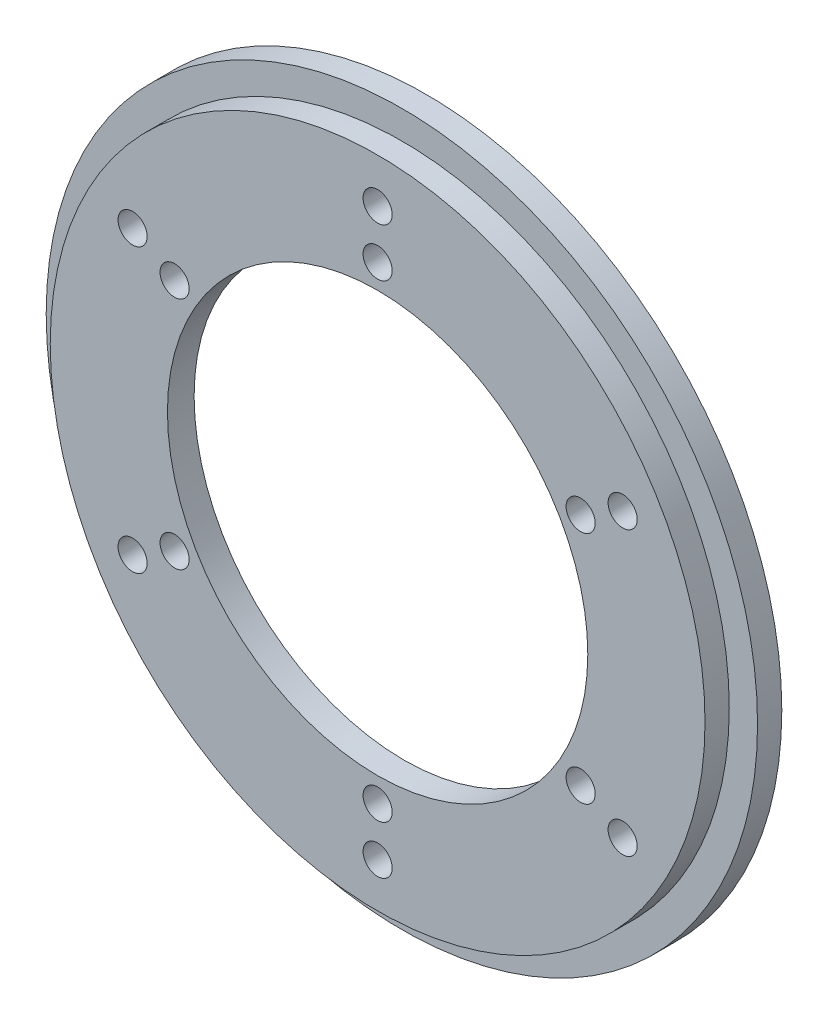
ISO-10303-21;
HEADER;
FILE_DESCRIPTION(('STEP AP214'),'2;1');
FILE_NAME('part.step','',(''),(''),'','','');
FILE_SCHEMA(('AUTOMOTIVE_DESIGN { 1 0 10303 214 1 1 1 1 }'));
ENDSEC;
DATA;
#1=APPLICATION_CONTEXT('core data for automotive mechanical design processes');
#2=APPLICATION_PROTOCOL_DEFINITION('international standard','automotive_design',2000,#1);
#3=PRODUCT_CONTEXT('',#1,'mechanical');
#4=PRODUCT('Part','Part','',(#3));
#5=PRODUCT_RELATED_PRODUCT_CATEGORY('part','',(#4));
#6=PRODUCT_DEFINITION_FORMATION('','',#4);
#7=PRODUCT_DEFINITION_CONTEXT('part definition',#1,'design');
#8=PRODUCT_DEFINITION('design','',#6,#7);
#9=PRODUCT_DEFINITION_SHAPE('','',#8);
#10=(LENGTH_UNIT() NAMED_UNIT(*) SI_UNIT(.MILLI.,.METRE.));
#11=(NAMED_UNIT(*) PLANE_ANGLE_UNIT() SI_UNIT($,.RADIAN.));
#12=(NAMED_UNIT(*) SI_UNIT($,.STERADIAN.) SOLID_ANGLE_UNIT());
#13=UNCERTAINTY_MEASURE_WITH_UNIT(LENGTH_MEASURE(1.E-05),#10,'distance_accuracy_value','');
#14=(GEOMETRIC_REPRESENTATION_CONTEXT(3) GLOBAL_UNCERTAINTY_ASSIGNED_CONTEXT((#13)) GLOBAL_UNIT_ASSIGNED_CONTEXT((#10,
#11,#12)) REPRESENTATION_CONTEXT('',''));
#15=CARTESIAN_POINT('',(0.,0.,0.));
#16=DIRECTION('',(0.,0.,1.));
#17=DIRECTION('',(1.,0.,0.));
#18=AXIS2_PLACEMENT_3D('',#15,#16,#17);
#19=CARTESIAN_POINT('',(0.,0.,0.));
#20=DIRECTION('',(0.,0.,-1.));
#21=DIRECTION('',(-1.,0.,0.));
#22=AXIS2_PLACEMENT_3D('',#19,#20,#21);
#23=PLANE('',#22);
#24=CARTESIAN_POINT('',(0.,0.,0.));
#25=DIRECTION('',(0.,0.,1.));
#26=DIRECTION('',(1.,0.,0.));
#27=AXIS2_PLACEMENT_3D('',#24,#25,#26);
#28=CIRCLE('',#27,44.);
#29=CARTESIAN_POINT('',(44.,0.,0.));
#30=VERTEX_POINT('',#29);
#31=EDGE_CURVE('E111',#30,#30,#28,.T.);
#32=ORIENTED_EDGE('',*,*,#31,.F.);
#33=EDGE_LOOP('',(#32));
#34=FACE_BOUND('',#33,.T.);
#35=CARTESIAN_POINT('',(0.,0.,0.));
#36=DIRECTION('',(0.,0.,-1.));
#37=DIRECTION('',(-1.,0.,0.));
#38=AXIS2_PLACEMENT_3D('',#35,#36,#37);
#39=CIRCLE('',#38,39.);
#40=CARTESIAN_POINT('',(-39.,0.,0.));
#41=VERTEX_POINT('',#40);
#42=EDGE_CURVE('E17',#41,#41,#39,.F.);
#43=ORIENTED_EDGE('',*,*,#42,.T.);
#44=EDGE_LOOP('',(#43));
#45=FACE_BOUND('',#44,.T.);
#46=ADVANCED_FACE('F14',(#34,#45),#23,.T.);
#47=CARTESIAN_POINT('',(0.,0.,1.35));
#48=DIRECTION('',(0.,0.,-1.));
#49=DIRECTION('',(-1.,0.,0.));
#50=AXIS2_PLACEMENT_3D('',#47,#48,#49);
#51=CYLINDRICAL_SURFACE('',#50,39.);
#52=ORIENTED_EDGE('',*,*,#42,.F.);
#53=EDGE_LOOP('',(#52));
#54=FACE_BOUND('',#53,.T.);
#55=CARTESIAN_POINT('',(0.,0.,2.7));
#56=DIRECTION('',(0.,0.,-1.));
#57=DIRECTION('',(-1.,0.,0.));
#58=AXIS2_PLACEMENT_3D('',#55,#56,#57);
#59=CIRCLE('',#58,39.);
#60=CARTESIAN_POINT('',(-39.,0.,2.7));
#61=VERTEX_POINT('',#60);
#62=EDGE_CURVE('E109',#61,#61,#59,.F.);
#63=ORIENTED_EDGE('',*,*,#62,.T.);
#64=EDGE_LOOP('',(#63));
#65=FACE_BOUND('',#64,.T.);
#66=ADVANCED_FACE('F119',(#54,#65),#51,.F.);
#67=CARTESIAN_POINT('',(0.,0.,0.));
#68=DIRECTION('',(0.,0.,1.));
#69=DIRECTION('',(1.,0.,0.));
#70=AXIS2_PLACEMENT_3D('',#67,#68,#69);
#71=CYLINDRICAL_SURFACE('',#70,44.);
#72=ORIENTED_EDGE('',*,*,#31,.T.);
#73=EDGE_LOOP('',(#72));
#74=FACE_BOUND('',#73,.T.);
#75=CARTESIAN_POINT('',(0.,0.,3.));
#76=DIRECTION('',(0.,0.,1.));
#77=DIRECTION('',(1.,0.,0.));
#78=AXIS2_PLACEMENT_3D('',#75,#76,#77);
#79=CIRCLE('',#78,44.);
#80=CARTESIAN_POINT('',(44.,0.,3.));
#81=VERTEX_POINT('',#80);
#82=EDGE_CURVE('E106',#81,#81,#79,.F.);
#83=ORIENTED_EDGE('',*,*,#82,.T.);
#84=EDGE_LOOP('',(#83));
#85=FACE_BOUND('',#84,.T.);
#86=ADVANCED_FACE('F122',(#74,#85),#71,.T.);
#87=CARTESIAN_POINT('',(0.,0.,2.7));
#88=DIRECTION('',(0.,0.,1.));
#89=DIRECTION('',(1.,0.,0.));
#90=AXIS2_PLACEMENT_3D('',#87,#88,#89);
#91=PLANE('',#90);
#92=ORIENTED_EDGE('',*,*,#62,.F.);
#93=EDGE_LOOP('',(#92));
#94=FACE_BOUND('',#93,.T.);
#95=CARTESIAN_POINT('',(0.,0.,2.7));
#96=DIRECTION('',(0.,0.,-1.));
#97=DIRECTION('',(-1.,0.,0.));
#98=AXIS2_PLACEMENT_3D('',#95,#96,#97);
#99=CIRCLE('',#98,26.);
#100=CARTESIAN_POINT('',(-26.,0.,2.7));
#101=VERTEX_POINT('',#100);
#102=EDGE_CURVE('E67',#101,#101,#99,.F.);
#103=ORIENTED_EDGE('',*,*,#102,.T.);
#104=EDGE_LOOP('',(#103));
#105=FACE_BOUND('',#104,.T.);
#106=CARTESIAN_POINT('',(30.3108891324554,17.5,2.69999999999999));
#107=DIRECTION('',(0.,0.,-1.));
#108=DIRECTION('',(-1.,0.,0.));
#109=AXIS2_PLACEMENT_3D('',#106,#107,#108);
#110=CIRCLE('',#109,1.8);
#111=CARTESIAN_POINT('',(28.5108891324554,17.5,2.69999999999999));
#112=VERTEX_POINT('',#111);
#113=EDGE_CURVE('E70',#112,#112,#110,.F.);
#114=ORIENTED_EDGE('',*,*,#113,.T.);
#115=EDGE_LOOP('',(#114));
#116=FACE_BOUND('',#115,.T.);
#117=CARTESIAN_POINT('',(25.1147367097487,-14.5,2.69999999999999));
#118=DIRECTION('',(0.,0.,-1.));
#119=DIRECTION('',(-1.,0.,0.));
#120=AXIS2_PLACEMENT_3D('',#117,#118,#119);
#121=CIRCLE('',#120,1.8);
#122=CARTESIAN_POINT('',(23.3147367097487,-14.5,2.69999999999999));
#123=VERTEX_POINT('',#122);
#124=EDGE_CURVE('E73',#123,#123,#121,.F.);
#125=ORIENTED_EDGE('',*,*,#124,.T.);
#126=EDGE_LOOP('',(#125));
#127=FACE_BOUND('',#126,.T.);
#128=CARTESIAN_POINT('',(0.,-35.,2.69999999999999));
#129=DIRECTION('',(0.,0.,-1.));
#130=DIRECTION('',(-1.,0.,0.));
#131=AXIS2_PLACEMENT_3D('',#128,#129,#130);
#132=CIRCLE('',#131,1.8);
#133=CARTESIAN_POINT('',(-1.80000000000001,-35.,2.69999999999999));
#134=VERTEX_POINT('',#133);
#135=EDGE_CURVE('E76',#134,#134,#132,.F.);
#136=ORIENTED_EDGE('',*,*,#135,.T.);
#137=EDGE_LOOP('',(#136));
#138=FACE_BOUND('',#137,.T.);
#139=CARTESIAN_POINT('',(-25.1147367097487,-14.5,2.69999999999999));
#140=DIRECTION('',(0.,0.,-1.));
#141=DIRECTION('',(-1.,0.,0.));
#142=AXIS2_PLACEMENT_3D('',#139,#140,#141);
#143=CIRCLE('',#142,1.8);
#144=CARTESIAN_POINT('',(-26.9147367097487,-14.5,2.69999999999999));
#145=VERTEX_POINT('',#144);
#146=EDGE_CURVE('E79',#145,#145,#143,.F.);
#147=ORIENTED_EDGE('',*,*,#146,.T.);
#148=EDGE_LOOP('',(#147));
#149=FACE_BOUND('',#148,.T.);
#150=CARTESIAN_POINT('',(-30.3108891324553,17.5,2.69999999999999));
#151=DIRECTION('',(0.,0.,-1.));
#152=DIRECTION('',(-1.,0.,0.));
#153=AXIS2_PLACEMENT_3D('',#150,#151,#152);
#154=CIRCLE('',#153,1.8);
#155=CARTESIAN_POINT('',(-32.1108891324553,17.5,2.69999999999999));
#156=VERTEX_POINT('',#155);
#157=EDGE_CURVE('E82',#156,#156,#154,.F.);
#158=ORIENTED_EDGE('',*,*,#157,.T.);
#159=EDGE_LOOP('',(#158));
#160=FACE_BOUND('',#159,.T.);
#161=CARTESIAN_POINT('',(0.,29.,2.69999999999999));
#162=DIRECTION('',(0.,0.,-1.));
#163=DIRECTION('',(-1.,0.,0.));
#164=AXIS2_PLACEMENT_3D('',#161,#162,#163);
#165=CIRCLE('',#164,1.8);
#166=CARTESIAN_POINT('',(-1.79999999999999,29.,2.69999999999999));
#167=VERTEX_POINT('',#166);
#168=EDGE_CURVE('E85',#167,#167,#165,.F.);
#169=ORIENTED_EDGE('',*,*,#168,.T.);
#170=EDGE_LOOP('',(#169));
#171=FACE_BOUND('',#170,.T.);
#172=CARTESIAN_POINT('',(0.,35.,2.69999999999999));
#173=DIRECTION('',(0.,0.,-1.));
#174=DIRECTION('',(-1.,0.,0.));
#175=AXIS2_PLACEMENT_3D('',#172,#173,#174);
#176=CIRCLE('',#175,1.8);
#177=CARTESIAN_POINT('',(-1.79999999999999,35.,2.69999999999999));
#178=VERTEX_POINT('',#177);
#179=EDGE_CURVE('E88',#178,#178,#176,.F.);
#180=ORIENTED_EDGE('',*,*,#179,.T.);
#181=EDGE_LOOP('',(#180));
#182=FACE_BOUND('',#181,.T.);
#183=CARTESIAN_POINT('',(-25.1147367097487,14.5,2.69999999999999));
#184=DIRECTION('',(0.,0.,-1.));
#185=DIRECTION('',(-1.,0.,0.));
#186=AXIS2_PLACEMENT_3D('',#183,#184,#185);
#187=CIRCLE('',#186,1.8);
#188=CARTESIAN_POINT('',(-26.9147367097487,14.5,2.69999999999999));
#189=VERTEX_POINT('',#188);
#190=EDGE_CURVE('E91',#189,#189,#187,.F.);
#191=ORIENTED_EDGE('',*,*,#190,.T.);
#192=EDGE_LOOP('',(#191));
#193=FACE_BOUND('',#192,.T.);
#194=CARTESIAN_POINT('',(-30.3108891324554,-17.5,2.69999999999999));
#195=DIRECTION('',(0.,0.,-1.));
#196=DIRECTION('',(-1.,0.,0.));
#197=AXIS2_PLACEMENT_3D('',#194,#195,#196);
#198=CIRCLE('',#197,1.8);
#199=CARTESIAN_POINT('',(-32.1108891324554,-17.5,2.69999999999999));
#200=VERTEX_POINT('',#199);
#201=EDGE_CURVE('E94',#200,#200,#198,.F.);
#202=ORIENTED_EDGE('',*,*,#201,.T.);
#203=EDGE_LOOP('',(#202));
#204=FACE_BOUND('',#203,.T.);
#205=CARTESIAN_POINT('',(0.,-29.,2.69999999999999));
#206=DIRECTION('',(0.,0.,-1.));
#207=DIRECTION('',(-1.,0.,0.));
#208=AXIS2_PLACEMENT_3D('',#205,#206,#207);
#209=CIRCLE('',#208,1.8);
#210=CARTESIAN_POINT('',(-1.80000000000001,-29.,2.69999999999999));
#211=VERTEX_POINT('',#210);
#212=EDGE_CURVE('E97',#211,#211,#209,.F.);
#213=ORIENTED_EDGE('',*,*,#212,.T.);
#214=EDGE_LOOP('',(#213));
#215=FACE_BOUND('',#214,.T.);
#216=CARTESIAN_POINT('',(30.3108891324553,-17.5,2.69999999999999));
#217=DIRECTION('',(0.,0.,-1.));
#218=DIRECTION('',(-1.,0.,0.));
#219=AXIS2_PLACEMENT_3D('',#216,#217,#218);
#220=CIRCLE('',#219,1.8);
#221=CARTESIAN_POINT('',(28.5108891324553,-17.5,2.69999999999999));
#222=VERTEX_POINT('',#221);
#223=EDGE_CURVE('E100',#222,#222,#220,.F.);
#224=ORIENTED_EDGE('',*,*,#223,.T.);
#225=EDGE_LOOP('',(#224));
#226=FACE_BOUND('',#225,.T.);
#227=CARTESIAN_POINT('',(25.1147367097487,14.5,2.69999999999999));
#228=DIRECTION('',(0.,0.,-1.));
#229=DIRECTION('',(-1.,0.,0.));
#230=AXIS2_PLACEMENT_3D('',#227,#228,#229);
#231=CIRCLE('',#230,1.8);
#232=CARTESIAN_POINT('',(23.3147367097487,14.5,2.69999999999999));
#233=VERTEX_POINT('',#232);
#234=EDGE_CURVE('E103',#233,#233,#231,.F.);
#235=ORIENTED_EDGE('',*,*,#234,.T.);
#236=EDGE_LOOP('',(#235));
#237=FACE_BOUND('',#236,.T.);
#238=ADVANCED_FACE('F125',(#94,#105,#116,#127,#138,#149,#160,#171,#182,#193,#204,#215,#226,
#237),#91,.F.);
#239=CARTESIAN_POINT('',(0.,0.,3.));
#240=DIRECTION('',(0.,0.,-1.));
#241=DIRECTION('',(-1.,0.,0.));
#242=AXIS2_PLACEMENT_3D('',#239,#240,#241);
#243=PLANE('',#242);
#244=ORIENTED_EDGE('',*,*,#82,.F.);
#245=EDGE_LOOP('',(#244));
#246=FACE_BOUND('',#245,.T.);
#247=CARTESIAN_POINT('',(0.,0.,3.));
#248=DIRECTION('',(0.,0.,1.));
#249=DIRECTION('',(1.,0.,0.));
#250=AXIS2_PLACEMENT_3D('',#247,#248,#249);
#251=CIRCLE('',#250,40.5);
#252=CARTESIAN_POINT('',(40.5,0.,3.));
#253=VERTEX_POINT('',#252);
#254=EDGE_CURVE('E64',#253,#253,#251,.T.);
#255=ORIENTED_EDGE('',*,*,#254,.F.);
#256=EDGE_LOOP('',(#255));
#257=FACE_BOUND('',#256,.T.);
#258=ADVANCED_FACE('F128',(#246,#257),#243,.F.);
#259=CARTESIAN_POINT('',(25.1147367097487,14.5,127.29534501738));
#260=DIRECTION('',(0.,0.,-1.));
#261=DIRECTION('',(-1.,0.,0.));
#262=AXIS2_PLACEMENT_3D('',#259,#260,#261);
#263=CYLINDRICAL_SURFACE('',#262,1.8);
#264=CARTESIAN_POINT('',(25.1147367097487,14.5,5.99999999999999));
#265=DIRECTION('',(0.,0.,-1.));
#266=DIRECTION('',(-1.,0.,0.));
#267=AXIS2_PLACEMENT_3D('',#264,#265,#266);
#268=CIRCLE('',#267,1.8);
#269=CARTESIAN_POINT('',(23.3147367097487,14.5,5.99999999999999));
#270=VERTEX_POINT('',#269);
#271=EDGE_CURVE('E61',#270,#270,#268,.F.);
#272=ORIENTED_EDGE('',*,*,#271,.T.);
#273=EDGE_LOOP('',(#272));
#274=FACE_BOUND('',#273,.T.);
#275=ORIENTED_EDGE('',*,*,#234,.F.);
#276=EDGE_LOOP('',(#275));
#277=FACE_BOUND('',#276,.T.);
#278=ADVANCED_FACE('F156',(#274,#277),#263,.F.);
#279=CARTESIAN_POINT('',(30.3108891324553,-17.5,127.29534501738));
#280=DIRECTION('',(0.,0.,-1.));
#281=DIRECTION('',(-1.,0.,0.));
#282=AXIS2_PLACEMENT_3D('',#279,#280,#281);
#283=CYLINDRICAL_SURFACE('',#282,1.8);
#284=CARTESIAN_POINT('',(30.3108891324553,-17.5,5.99999999999999));
#285=DIRECTION('',(0.,0.,-1.));
#286=DIRECTION('',(-1.,0.,0.));
#287=AXIS2_PLACEMENT_3D('',#284,#285,#286);
#288=CIRCLE('',#287,1.8);
#289=CARTESIAN_POINT('',(28.5108891324553,-17.5,5.99999999999999));
#290=VERTEX_POINT('',#289);
#291=EDGE_CURVE('E58',#290,#290,#288,.F.);
#292=ORIENTED_EDGE('',*,*,#291,.T.);
#293=EDGE_LOOP('',(#292));
#294=FACE_BOUND('',#293,.T.);
#295=ORIENTED_EDGE('',*,*,#223,.F.);
#296=EDGE_LOOP('',(#295));
#297=FACE_BOUND('',#296,.T.);
#298=ADVANCED_FACE('F158',(#294,#297),#283,.F.);
#299=CARTESIAN_POINT('',(0.,-29.,127.29534501738));
#300=DIRECTION('',(0.,0.,-1.));
#301=DIRECTION('',(-1.,0.,0.));
#302=AXIS2_PLACEMENT_3D('',#299,#300,#301);
#303=CYLINDRICAL_SURFACE('',#302,1.8);
#304=CARTESIAN_POINT('',(0.,-29.,5.99999999999999));
#305=DIRECTION('',(0.,0.,-1.));
#306=DIRECTION('',(-1.,0.,0.));
#307=AXIS2_PLACEMENT_3D('',#304,#305,#306);
#308=CIRCLE('',#307,1.8);
#309=CARTESIAN_POINT('',(-1.80000000000001,-29.,5.99999999999999));
#310=VERTEX_POINT('',#309);
#311=EDGE_CURVE('E55',#310,#310,#308,.F.);
#312=ORIENTED_EDGE('',*,*,#311,.T.);
#313=EDGE_LOOP('',(#312));
#314=FACE_BOUND('',#313,.T.);
#315=ORIENTED_EDGE('',*,*,#212,.F.);
#316=EDGE_LOOP('',(#315));
#317=FACE_BOUND('',#316,.T.);
#318=ADVANCED_FACE('F166',(#314,#317),#303,.F.);
#319=CARTESIAN_POINT('',(-30.3108891324554,-17.5,127.29534501738));
#320=DIRECTION('',(0.,0.,-1.));
#321=DIRECTION('',(-1.,0.,0.));
#322=AXIS2_PLACEMENT_3D('',#319,#320,#321);
#323=CYLINDRICAL_SURFACE('',#322,1.8);
#324=CARTESIAN_POINT('',(-30.3108891324554,-17.5,5.99999999999999));
#325=DIRECTION('',(0.,0.,-1.));
#326=DIRECTION('',(-1.,0.,0.));
#327=AXIS2_PLACEMENT_3D('',#324,#325,#326);
#328=CIRCLE('',#327,1.8);
#329=CARTESIAN_POINT('',(-32.1108891324554,-17.5,5.99999999999999));
#330=VERTEX_POINT('',#329);
#331=EDGE_CURVE('E52',#330,#330,#328,.F.);
#332=ORIENTED_EDGE('',*,*,#331,.T.);
#333=EDGE_LOOP('',(#332));
#334=FACE_BOUND('',#333,.T.);
#335=ORIENTED_EDGE('',*,*,#201,.F.);
#336=EDGE_LOOP('',(#335));
#337=FACE_BOUND('',#336,.T.);
#338=ADVANCED_FACE('F218',(#334,#337),#323,.F.);
#339=CARTESIAN_POINT('',(-25.1147367097487,14.5,127.29534501738));
#340=DIRECTION('',(0.,0.,-1.));
#341=DIRECTION('',(-1.,0.,0.));
#342=AXIS2_PLACEMENT_3D('',#339,#340,#341);
#343=CYLINDRICAL_SURFACE('',#342,1.8);
#344=CARTESIAN_POINT('',(-25.1147367097487,14.5,5.99999999999999));
#345=DIRECTION('',(0.,0.,-1.));
#346=DIRECTION('',(-1.,0.,0.));
#347=AXIS2_PLACEMENT_3D('',#344,#345,#346);
#348=CIRCLE('',#347,1.8);
#349=CARTESIAN_POINT('',(-26.9147367097487,14.5,5.99999999999999));
#350=VERTEX_POINT('',#349);
#351=EDGE_CURVE('E49',#350,#350,#348,.F.);
#352=ORIENTED_EDGE('',*,*,#351,.T.);
#353=EDGE_LOOP('',(#352));
#354=FACE_BOUND('',#353,.T.);
#355=ORIENTED_EDGE('',*,*,#190,.F.);
#356=EDGE_LOOP('',(#355));
#357=FACE_BOUND('',#356,.T.);
#358=ADVANCED_FACE('F214',(#354,#357),#343,.F.);
#359=CARTESIAN_POINT('',(0.,35.,127.29534501738));
#360=DIRECTION('',(0.,0.,-1.));
#361=DIRECTION('',(-1.,0.,0.));
#362=AXIS2_PLACEMENT_3D('',#359,#360,#361);
#363=CYLINDRICAL_SURFACE('',#362,1.8);
#364=CARTESIAN_POINT('',(0.,35.,5.99999999999999));
#365=DIRECTION('',(0.,0.,-1.));
#366=DIRECTION('',(-1.,0.,0.));
#367=AXIS2_PLACEMENT_3D('',#364,#365,#366);
#368=CIRCLE('',#367,1.8);
#369=CARTESIAN_POINT('',(-1.79999999999999,35.,5.99999999999999));
#370=VERTEX_POINT('',#369);
#371=EDGE_CURVE('E46',#370,#370,#368,.F.);
#372=ORIENTED_EDGE('',*,*,#371,.T.);
#373=EDGE_LOOP('',(#372));
#374=FACE_BOUND('',#373,.T.);
#375=ORIENTED_EDGE('',*,*,#179,.F.);
#376=EDGE_LOOP('',(#375));
#377=FACE_BOUND('',#376,.T.);
#378=ADVANCED_FACE('F210',(#374,#377),#363,.F.);
#379=CARTESIAN_POINT('',(0.,29.,127.29534501738));
#380=DIRECTION('',(0.,0.,-1.));
#381=DIRECTION('',(-1.,0.,0.));
#382=AXIS2_PLACEMENT_3D('',#379,#380,#381);
#383=CYLINDRICAL_SURFACE('',#382,1.8);
#384=CARTESIAN_POINT('',(0.,29.,5.99999999999999));
#385=DIRECTION('',(0.,0.,-1.));
#386=DIRECTION('',(-1.,0.,0.));
#387=AXIS2_PLACEMENT_3D('',#384,#385,#386);
#388=CIRCLE('',#387,1.8);
#389=CARTESIAN_POINT('',(-1.79999999999999,29.,5.99999999999999));
#390=VERTEX_POINT('',#389);
#391=EDGE_CURVE('E43',#390,#390,#388,.F.);
#392=ORIENTED_EDGE('',*,*,#391,.T.);
#393=EDGE_LOOP('',(#392));
#394=FACE_BOUND('',#393,.T.);
#395=ORIENTED_EDGE('',*,*,#168,.F.);
#396=EDGE_LOOP('',(#395));
#397=FACE_BOUND('',#396,.T.);
#398=ADVANCED_FACE('F206',(#394,#397),#383,.F.);
#399=CARTESIAN_POINT('',(-30.3108891324553,17.5,127.29534501738));
#400=DIRECTION('',(0.,0.,-1.));
#401=DIRECTION('',(-1.,0.,0.));
#402=AXIS2_PLACEMENT_3D('',#399,#400,#401);
#403=CYLINDRICAL_SURFACE('',#402,1.8);
#404=CARTESIAN_POINT('',(-30.3108891324553,17.5,5.99999999999999));
#405=DIRECTION('',(0.,0.,-1.));
#406=DIRECTION('',(-1.,0.,0.));
#407=AXIS2_PLACEMENT_3D('',#404,#405,#406);
#408=CIRCLE('',#407,1.8);
#409=CARTESIAN_POINT('',(-32.1108891324553,17.5,5.99999999999999));
#410=VERTEX_POINT('',#409);
#411=EDGE_CURVE('E40',#410,#410,#408,.F.);
#412=ORIENTED_EDGE('',*,*,#411,.T.);
#413=EDGE_LOOP('',(#412));
#414=FACE_BOUND('',#413,.T.);
#415=ORIENTED_EDGE('',*,*,#157,.F.);
#416=EDGE_LOOP('',(#415));
#417=FACE_BOUND('',#416,.T.);
#418=ADVANCED_FACE('F202',(#414,#417),#403,.F.);
#419=CARTESIAN_POINT('',(-25.1147367097487,-14.5,127.29534501738));
#420=DIRECTION('',(0.,0.,-1.));
#421=DIRECTION('',(-1.,0.,0.));
#422=AXIS2_PLACEMENT_3D('',#419,#420,#421);
#423=CYLINDRICAL_SURFACE('',#422,1.8);
#424=CARTESIAN_POINT('',(-25.1147367097487,-14.5,5.99999999999999));
#425=DIRECTION('',(0.,0.,-1.));
#426=DIRECTION('',(-1.,0.,0.));
#427=AXIS2_PLACEMENT_3D('',#424,#425,#426);
#428=CIRCLE('',#427,1.8);
#429=CARTESIAN_POINT('',(-26.9147367097487,-14.5,5.99999999999999));
#430=VERTEX_POINT('',#429);
#431=EDGE_CURVE('E37',#430,#430,#428,.F.);
#432=ORIENTED_EDGE('',*,*,#431,.T.);
#433=EDGE_LOOP('',(#432));
#434=FACE_BOUND('',#433,.T.);
#435=ORIENTED_EDGE('',*,*,#146,.F.);
#436=EDGE_LOOP('',(#435));
#437=FACE_BOUND('',#436,.T.);
#438=ADVANCED_FACE('F198',(#434,#437),#423,.F.);
#439=CARTESIAN_POINT('',(0.,-35.,127.29534501738));
#440=DIRECTION('',(0.,0.,-1.));
#441=DIRECTION('',(-1.,0.,0.));
#442=AXIS2_PLACEMENT_3D('',#439,#440,#441);
#443=CYLINDRICAL_SURFACE('',#442,1.8);
#444=CARTESIAN_POINT('',(0.,-35.,5.99999999999999));
#445=DIRECTION('',(0.,0.,-1.));
#446=DIRECTION('',(-1.,0.,0.));
#447=AXIS2_PLACEMENT_3D('',#444,#445,#446);
#448=CIRCLE('',#447,1.8);
#449=CARTESIAN_POINT('',(-1.80000000000001,-35.,5.99999999999999));
#450=VERTEX_POINT('',#449);
#451=EDGE_CURVE('E34',#450,#450,#448,.F.);
#452=ORIENTED_EDGE('',*,*,#451,.T.);
#453=EDGE_LOOP('',(#452));
#454=FACE_BOUND('',#453,.T.);
#455=ORIENTED_EDGE('',*,*,#135,.F.);
#456=EDGE_LOOP('',(#455));
#457=FACE_BOUND('',#456,.T.);
#458=ADVANCED_FACE('F194',(#454,#457),#443,.F.);
#459=CARTESIAN_POINT('',(25.1147367097487,-14.5,127.29534501738));
#460=DIRECTION('',(0.,0.,-1.));
#461=DIRECTION('',(-1.,0.,0.));
#462=AXIS2_PLACEMENT_3D('',#459,#460,#461);
#463=CYLINDRICAL_SURFACE('',#462,1.8);
#464=CARTESIAN_POINT('',(25.1147367097487,-14.5,5.99999999999999));
#465=DIRECTION('',(0.,0.,-1.));
#466=DIRECTION('',(-1.,0.,0.));
#467=AXIS2_PLACEMENT_3D('',#464,#465,#466);
#468=CIRCLE('',#467,1.8);
#469=CARTESIAN_POINT('',(23.3147367097487,-14.5,5.99999999999999));
#470=VERTEX_POINT('',#469);
#471=EDGE_CURVE('E31',#470,#470,#468,.F.);
#472=ORIENTED_EDGE('',*,*,#471,.T.);
#473=EDGE_LOOP('',(#472));
#474=FACE_BOUND('',#473,.T.);
#475=ORIENTED_EDGE('',*,*,#124,.F.);
#476=EDGE_LOOP('',(#475));
#477=FACE_BOUND('',#476,.T.);
#478=ADVANCED_FACE('F190',(#474,#477),#463,.F.);
#479=CARTESIAN_POINT('',(30.3108891324554,17.5,127.29534501738));
#480=DIRECTION('',(0.,0.,-1.));
#481=DIRECTION('',(-1.,0.,0.));
#482=AXIS2_PLACEMENT_3D('',#479,#480,#481);
#483=CYLINDRICAL_SURFACE('',#482,1.8);
#484=CARTESIAN_POINT('',(30.3108891324554,17.5,5.99999999999999));
#485=DIRECTION('',(0.,0.,-1.));
#486=DIRECTION('',(-1.,0.,0.));
#487=AXIS2_PLACEMENT_3D('',#484,#485,#486);
#488=CIRCLE('',#487,1.8);
#489=CARTESIAN_POINT('',(28.5108891324554,17.5,5.99999999999999));
#490=VERTEX_POINT('',#489);
#491=EDGE_CURVE('E26',#490,#490,#488,.F.);
#492=ORIENTED_EDGE('',*,*,#491,.T.);
#493=EDGE_LOOP('',(#492));
#494=FACE_BOUND('',#493,.T.);
#495=ORIENTED_EDGE('',*,*,#113,.F.);
#496=EDGE_LOOP('',(#495));
#497=FACE_BOUND('',#496,.T.);
#498=ADVANCED_FACE('F186',(#494,#497),#483,.F.);
#499=CARTESIAN_POINT('',(0.,0.,4.45));
#500=DIRECTION('',(0.,0.,-1.));
#501=DIRECTION('',(-1.,0.,0.));
#502=AXIS2_PLACEMENT_3D('',#499,#500,#501);
#503=CYLINDRICAL_SURFACE('',#502,26.);
#504=CARTESIAN_POINT('',(0.,0.,6.));
#505=DIRECTION('',(0.,0.,-1.));
#506=DIRECTION('',(-1.,0.,0.));
#507=AXIS2_PLACEMENT_3D('',#504,#505,#506);
#508=CIRCLE('',#507,26.);
#509=CARTESIAN_POINT('',(-26.,0.,6.));
#510=VERTEX_POINT('',#509);
#511=EDGE_CURVE('E21',#510,#510,#508,.F.);
#512=ORIENTED_EDGE('',*,*,#511,.T.);
#513=EDGE_LOOP('',(#512));
#514=FACE_BOUND('',#513,.T.);
#515=ORIENTED_EDGE('',*,*,#102,.F.);
#516=EDGE_LOOP('',(#515));
#517=FACE_BOUND('',#516,.T.);
#518=ADVANCED_FACE('F179',(#514,#517),#503,.F.);
#519=CARTESIAN_POINT('',(0.,0.,3.));
#520=DIRECTION('',(0.,0.,1.));
#521=DIRECTION('',(1.,0.,0.));
#522=AXIS2_PLACEMENT_3D('',#519,#520,#521);
#523=CYLINDRICAL_SURFACE('',#522,40.5);
#524=ORIENTED_EDGE('',*,*,#254,.T.);
#525=EDGE_LOOP('',(#524));
#526=FACE_BOUND('',#525,.T.);
#527=CARTESIAN_POINT('',(0.,0.,6.));
#528=DIRECTION('',(0.,0.,1.));
#529=DIRECTION('',(1.,0.,0.));
#530=AXIS2_PLACEMENT_3D('',#527,#528,#529);
#531=CIRCLE('',#530,40.5);
#532=CARTESIAN_POINT('',(40.5,0.,6.));
#533=VERTEX_POINT('',#532);
#534=EDGE_CURVE('E9',#533,#533,#531,.F.);
#535=ORIENTED_EDGE('',*,*,#534,.T.);
#536=EDGE_LOOP('',(#535));
#537=FACE_BOUND('',#536,.T.);
#538=ADVANCED_FACE('F173',(#526,#537),#523,.T.);
#539=CARTESIAN_POINT('',(0.,0.,6.));
#540=DIRECTION('',(0.,0.,-1.));
#541=DIRECTION('',(-1.,0.,0.));
#542=AXIS2_PLACEMENT_3D('',#539,#540,#541);
#543=PLANE('',#542);
#544=ORIENTED_EDGE('',*,*,#534,.F.);
#545=EDGE_LOOP('',(#544));
#546=FACE_BOUND('',#545,.T.);
#547=ORIENTED_EDGE('',*,*,#511,.F.);
#548=EDGE_LOOP('',(#547));
#549=FACE_BOUND('',#548,.T.);
#550=ORIENTED_EDGE('',*,*,#491,.F.);
#551=EDGE_LOOP('',(#550));
#552=FACE_BOUND('',#551,.T.);
#553=ORIENTED_EDGE('',*,*,#471,.F.);
#554=EDGE_LOOP('',(#553));
#555=FACE_BOUND('',#554,.T.);
#556=ORIENTED_EDGE('',*,*,#451,.F.);
#557=EDGE_LOOP('',(#556));
#558=FACE_BOUND('',#557,.T.);
#559=ORIENTED_EDGE('',*,*,#431,.F.);
#560=EDGE_LOOP('',(#559));
#561=FACE_BOUND('',#560,.T.);
#562=ORIENTED_EDGE('',*,*,#411,.F.);
#563=EDGE_LOOP('',(#562));
#564=FACE_BOUND('',#563,.T.);
#565=ORIENTED_EDGE('',*,*,#391,.F.);
#566=EDGE_LOOP('',(#565));
#567=FACE_BOUND('',#566,.T.);
#568=ORIENTED_EDGE('',*,*,#371,.F.);
#569=EDGE_LOOP('',(#568));
#570=FACE_BOUND('',#569,.T.);
#571=ORIENTED_EDGE('',*,*,#351,.F.);
#572=EDGE_LOOP('',(#571));
#573=FACE_BOUND('',#572,.T.);
#574=ORIENTED_EDGE('',*,*,#331,.F.);
#575=EDGE_LOOP('',(#574));
#576=FACE_BOUND('',#575,.T.);
#577=ORIENTED_EDGE('',*,*,#311,.F.);
#578=EDGE_LOOP('',(#577));
#579=FACE_BOUND('',#578,.T.);
#580=ORIENTED_EDGE('',*,*,#291,.F.);
#581=EDGE_LOOP('',(#580));
#582=FACE_BOUND('',#581,.T.);
#583=ORIENTED_EDGE('',*,*,#271,.F.);
#584=EDGE_LOOP('',(#583));
#585=FACE_BOUND('',#584,.T.);
#586=ADVANCED_FACE('F171',(#546,#549,#552,#555,#558,#561,#564,#567,#570,#573,#576,#579,#582,
#585),#543,.F.);
#587=CLOSED_SHELL('',(#46,#66,#86,#238,#258,#278,#298,#318,#338,#358,#378,#398,#418,#438,#458,
#478,#498,#518,#538,#586));
#588=MANIFOLD_SOLID_BREP('B1',#587);
#589=ADVANCED_BREP_SHAPE_REPRESENTATION('',(#18,#588),#14);
#590=SHAPE_DEFINITION_REPRESENTATION(#9,#589);
ENDSEC;
END-ISO-10303-21;
